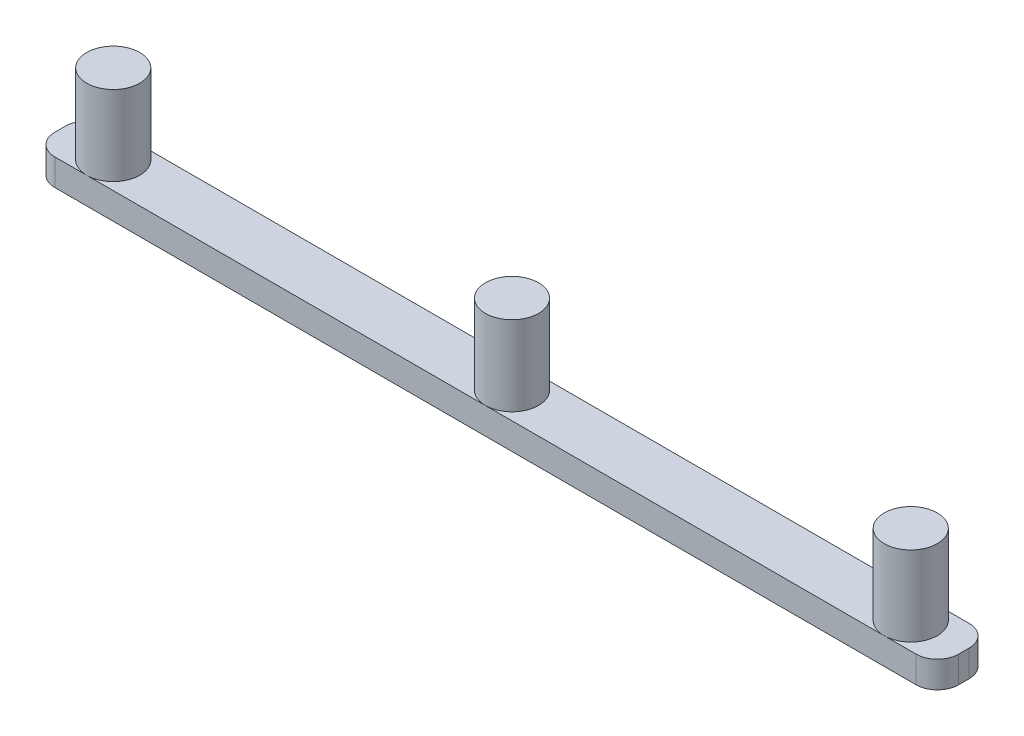
ISO-10303-21;
HEADER;
FILE_DESCRIPTION(('STEP AP214'),'2;1');
FILE_NAME('part.step','',(''),(''),'','','');
FILE_SCHEMA(('AUTOMOTIVE_DESIGN { 1 0 10303 214 1 1 1 1 }'));
ENDSEC;
DATA;
#1=APPLICATION_CONTEXT('core data for automotive mechanical design processes');
#2=APPLICATION_PROTOCOL_DEFINITION('international standard','automotive_design',2000,#1);
#3=PRODUCT_CONTEXT('',#1,'mechanical');
#4=PRODUCT('Part','Part','',(#3));
#5=PRODUCT_RELATED_PRODUCT_CATEGORY('part','',(#4));
#6=PRODUCT_DEFINITION_FORMATION('','',#4);
#7=PRODUCT_DEFINITION_CONTEXT('part definition',#1,'design');
#8=PRODUCT_DEFINITION('design','',#6,#7);
#9=PRODUCT_DEFINITION_SHAPE('','',#8);
#10=(LENGTH_UNIT() NAMED_UNIT(*) SI_UNIT(.MILLI.,.METRE.));
#11=(NAMED_UNIT(*) PLANE_ANGLE_UNIT() SI_UNIT($,.RADIAN.));
#12=(NAMED_UNIT(*) SI_UNIT($,.STERADIAN.) SOLID_ANGLE_UNIT());
#13=UNCERTAINTY_MEASURE_WITH_UNIT(LENGTH_MEASURE(1.E-05),#10,'distance_accuracy_value','');
#14=(GEOMETRIC_REPRESENTATION_CONTEXT(3) GLOBAL_UNCERTAINTY_ASSIGNED_CONTEXT((#13)) GLOBAL_UNIT_ASSIGNED_CONTEXT((#10,
#11,#12)) REPRESENTATION_CONTEXT('',''));
#15=CARTESIAN_POINT('',(0.,0.,0.));
#16=DIRECTION('',(0.,0.,1.));
#17=DIRECTION('',(1.,0.,0.));
#18=AXIS2_PLACEMENT_3D('',#15,#16,#17);
#19=CARTESIAN_POINT('',(-4.,5.,-6.));
#20=DIRECTION('',(0.,1.,0.));
#21=DIRECTION('',(0.,0.,1.));
#22=AXIS2_PLACEMENT_3D('',#19,#20,#21);
#23=PLANE('',#22);
#24=DIRECTION('',(1.,0.,0.));
#25=VECTOR('',#24,1.);
#26=CARTESIAN_POINT('',(-4.00000000000003,5.,0.));
#27=LINE('',#26,#25);
#28=CARTESIAN_POINT('',(-85.,5.,0.));
#29=VERTEX_POINT('',#28);
#30=CARTESIAN_POINT('',(-10.,5.,0.));
#31=VERTEX_POINT('',#30);
#32=EDGE_CURVE('E128',#29,#31,#27,.T.);
#33=ORIENTED_EDGE('',*,*,#32,.T.);
#34=CARTESIAN_POINT('',(-10.,5.,-5.));
#35=DIRECTION('',(0.,1.,0.));
#36=DIRECTION('',(0.,0.,1.));
#37=AXIS2_PLACEMENT_3D('',#34,#35,#36);
#38=CIRCLE('',#37,5.);
#39=CARTESIAN_POINT('',(-10.,5.,-10.));
#40=VERTEX_POINT('',#39);
#41=EDGE_CURVE('E49',#40,#31,#38,.T.);
#42=ORIENTED_EDGE('',*,*,#41,.F.);
#43=DIRECTION('',(-1.,0.,0.));
#44=VECTOR('',#43,1.);
#45=CARTESIAN_POINT('',(-4.00000000000003,5.,-10.));
#46=LINE('',#45,#44);
#47=CARTESIAN_POINT('',(-85.,5.,-9.99999999999999));
#48=VERTEX_POINT('',#47);
#49=EDGE_CURVE('E126',#40,#48,#46,.T.);
#50=ORIENTED_EDGE('',*,*,#49,.T.);
#51=CARTESIAN_POINT('',(-85.,5.,-5.));
#52=DIRECTION('',(0.,1.,0.));
#53=DIRECTION('',(0.,0.,1.));
#54=AXIS2_PLACEMENT_3D('',#51,#52,#53);
#55=CIRCLE('',#54,5.);
#56=EDGE_CURVE('E160',#29,#48,#55,.T.);
#57=ORIENTED_EDGE('',*,*,#56,.F.);
#58=EDGE_LOOP('',(#33,#42,#50,#57));
#59=FACE_BOUND('',#58,.T.);
#60=ADVANCED_FACE('F33',(#59),#23,.T.);
#61=CARTESIAN_POINT('',(-4.00000000000003,5.,-10.));
#62=VERTEX_POINT('',#61);
#63=EDGE_CURVE('E133',#62,#40,#46,.T.);
#64=ORIENTED_EDGE('',*,*,#63,.T.);
#65=EDGE_CURVE('E116',#31,#40,#38,.T.);
#66=ORIENTED_EDGE('',*,*,#65,.F.);
#67=CARTESIAN_POINT('',(-4.00000000000003,5.,0.));
#68=VERTEX_POINT('',#67);
#69=EDGE_CURVE('E216',#31,#68,#27,.T.);
#70=ORIENTED_EDGE('',*,*,#69,.T.);
#71=CARTESIAN_POINT('',(-4.,5.,-4.));
#72=DIRECTION('',(0.,1.,0.));
#73=DIRECTION('',(0.,0.,-1.));
#74=AXIS2_PLACEMENT_3D('',#71,#72,#73);
#75=CIRCLE('',#74,4.);
#76=CARTESIAN_POINT('',(0.,5.,-4.00000000000003));
#77=VERTEX_POINT('',#76);
#78=EDGE_CURVE('E215',#68,#77,#75,.T.);
#79=ORIENTED_EDGE('',*,*,#78,.T.);
#80=DIRECTION('',(0.,0.,-1.));
#81=VECTOR('',#80,1.);
#82=CARTESIAN_POINT('',(0.,5.,-4.00000000000003));
#83=LINE('',#82,#81);
#84=CARTESIAN_POINT('',(0.,5.,-5.99999999999997));
#85=VERTEX_POINT('',#84);
#86=EDGE_CURVE('E222',#77,#85,#83,.T.);
#87=ORIENTED_EDGE('',*,*,#86,.T.);
#88=CARTESIAN_POINT('',(-4.,5.,-6.));
#89=DIRECTION('',(0.,1.,0.));
#90=DIRECTION('',(0.,0.,1.));
#91=AXIS2_PLACEMENT_3D('',#88,#89,#90);
#92=CIRCLE('',#91,4.);
#93=EDGE_CURVE('E140',#85,#62,#92,.T.);
#94=ORIENTED_EDGE('',*,*,#93,.T.);
#95=EDGE_LOOP('',(#64,#66,#70,#79,#87,#94));
#96=FACE_BOUND('',#95,.T.);
#97=ADVANCED_FACE('F138',(#96),#23,.T.);
#98=CARTESIAN_POINT('',(-160.,5.,0.));
#99=VERTEX_POINT('',#98);
#100=EDGE_CURVE('E210',#99,#29,#27,.T.);
#101=ORIENTED_EDGE('',*,*,#100,.T.);
#102=EDGE_CURVE('E56',#48,#29,#55,.T.);
#103=ORIENTED_EDGE('',*,*,#102,.F.);
#104=CARTESIAN_POINT('',(-160.,5.,-9.99999999999998));
#105=VERTEX_POINT('',#104);
#106=EDGE_CURVE('E136',#48,#105,#46,.T.);
#107=ORIENTED_EDGE('',*,*,#106,.T.);
#108=CARTESIAN_POINT('',(-160.,5.,-5.));
#109=DIRECTION('',(0.,1.,0.));
#110=DIRECTION('',(0.,0.,1.));
#111=AXIS2_PLACEMENT_3D('',#108,#109,#110);
#112=CIRCLE('',#111,4.99999999999999);
#113=EDGE_CURVE('E43',#99,#105,#112,.T.);
#114=ORIENTED_EDGE('',*,*,#113,.F.);
#115=EDGE_LOOP('',(#101,#103,#107,#114));
#116=FACE_BOUND('',#115,.T.);
#117=ADVANCED_FACE('F186',(#116),#23,.T.);
#118=CARTESIAN_POINT('',(-4.,5.,-6.));
#119=DIRECTION('',(0.,-1.,0.));
#120=DIRECTION('',(0.,0.,-1.));
#121=AXIS2_PLACEMENT_3D('',#118,#119,#120);
#122=CYLINDRICAL_SURFACE('',#121,4.);
#123=CARTESIAN_POINT('',(-4.,0.,-6.));
#124=DIRECTION('',(0.,1.,0.));
#125=DIRECTION('',(0.,0.,1.));
#126=AXIS2_PLACEMENT_3D('',#123,#124,#125);
#127=CIRCLE('',#126,4.);
#128=CARTESIAN_POINT('',(0.,0.,-5.99999999999997));
#129=VERTEX_POINT('',#128);
#130=CARTESIAN_POINT('',(-4.00000000000003,0.,-10.));
#131=VERTEX_POINT('',#130);
#132=EDGE_CURVE('E159',#129,#131,#127,.T.);
#133=ORIENTED_EDGE('',*,*,#132,.T.);
#134=DIRECTION('',(0.,-1.,0.));
#135=VECTOR('',#134,1.);
#136=CARTESIAN_POINT('',(-4.00000000000003,5.,-10.));
#137=LINE('',#136,#135);
#138=EDGE_CURVE('E37',#62,#131,#137,.T.);
#139=ORIENTED_EDGE('',*,*,#138,.F.);
#140=ORIENTED_EDGE('',*,*,#93,.F.);
#141=DIRECTION('',(0.,-1.,0.));
#142=VECTOR('',#141,1.);
#143=CARTESIAN_POINT('',(0.,5.,-5.99999999999997));
#144=LINE('',#143,#142);
#145=EDGE_CURVE('E224',#85,#129,#144,.T.);
#146=ORIENTED_EDGE('',*,*,#145,.T.);
#147=EDGE_LOOP('',(#133,#139,#140,#146));
#148=FACE_BOUND('',#147,.T.);
#149=ADVANCED_FACE('F35',(#148),#122,.T.);
#150=CARTESIAN_POINT('',(-4.00000000000003,5.,-10.));
#151=DIRECTION('',(0.,0.,1.));
#152=DIRECTION('',(1.,0.,0.));
#153=AXIS2_PLACEMENT_3D('',#150,#151,#152);
#154=PLANE('',#153);
#155=DIRECTION('',(-1.,0.,0.));
#156=VECTOR('',#155,1.);
#157=CARTESIAN_POINT('',(-4.00000000000003,0.,-10.));
#158=LINE('',#157,#156);
#159=CARTESIAN_POINT('',(-166.,0.,-9.99999999999998));
#160=VERTEX_POINT('',#159);
#161=EDGE_CURVE('E227',#131,#160,#158,.T.);
#162=ORIENTED_EDGE('',*,*,#161,.T.);
#163=DIRECTION('',(0.,-1.,0.));
#164=VECTOR('',#163,1.);
#165=CARTESIAN_POINT('',(-166.,5.,-9.99999999999998));
#166=LINE('',#165,#164);
#167=CARTESIAN_POINT('',(-166.,5.,-9.99999999999998));
#168=VERTEX_POINT('',#167);
#169=EDGE_CURVE('E254',#168,#160,#166,.T.);
#170=ORIENTED_EDGE('',*,*,#169,.F.);
#171=EDGE_CURVE('E143',#105,#168,#46,.T.);
#172=ORIENTED_EDGE('',*,*,#171,.F.);
#173=ORIENTED_EDGE('',*,*,#106,.F.);
#174=ORIENTED_EDGE('',*,*,#49,.F.);
#175=ORIENTED_EDGE('',*,*,#63,.F.);
#176=ORIENTED_EDGE('',*,*,#138,.T.);
#177=EDGE_LOOP('',(#162,#170,#172,#173,#174,#175,#176));
#178=FACE_BOUND('',#177,.T.);
#179=ADVANCED_FACE('F131',(#178),#154,.F.);
#180=CARTESIAN_POINT('',(-166.,5.,-5.99999999999998));
#181=DIRECTION('',(0.,-1.,0.));
#182=DIRECTION('',(0.,0.,-1.));
#183=AXIS2_PLACEMENT_3D('',#180,#181,#182);
#184=CYLINDRICAL_SURFACE('',#183,4.);
#185=CARTESIAN_POINT('',(-166.,0.,-5.99999999999998));
#186=DIRECTION('',(0.,1.,0.));
#187=DIRECTION('',(0.,0.,-1.));
#188=AXIS2_PLACEMENT_3D('',#185,#186,#187);
#189=CIRCLE('',#188,4.);
#190=CARTESIAN_POINT('',(-170.,0.,-5.99999999999995));
#191=VERTEX_POINT('',#190);
#192=EDGE_CURVE('E229',#160,#191,#189,.T.);
#193=ORIENTED_EDGE('',*,*,#192,.T.);
#194=DIRECTION('',(0.,-1.,0.));
#195=VECTOR('',#194,1.);
#196=CARTESIAN_POINT('',(-170.,5.,-5.99999999999995));
#197=LINE('',#196,#195);
#198=CARTESIAN_POINT('',(-170.,5.,-5.99999999999995));
#199=VERTEX_POINT('',#198);
#200=EDGE_CURVE('E252',#199,#191,#197,.T.);
#201=ORIENTED_EDGE('',*,*,#200,.F.);
#202=CARTESIAN_POINT('',(-166.,5.,-5.99999999999998));
#203=DIRECTION('',(0.,1.,0.));
#204=DIRECTION('',(0.,0.,-1.));
#205=AXIS2_PLACEMENT_3D('',#202,#203,#204);
#206=CIRCLE('',#205,4.);
#207=EDGE_CURVE('E142',#168,#199,#206,.T.);
#208=ORIENTED_EDGE('',*,*,#207,.F.);
#209=ORIENTED_EDGE('',*,*,#169,.T.);
#210=EDGE_LOOP('',(#193,#201,#208,#209));
#211=FACE_BOUND('',#210,.T.);
#212=ADVANCED_FACE('F266',(#211),#184,.T.);
#213=CARTESIAN_POINT('',(-170.,5.,-4.00000000000001));
#214=DIRECTION('',(1.,0.,0.));
#215=DIRECTION('',(0.,0.,-1.));
#216=AXIS2_PLACEMENT_3D('',#213,#214,#215);
#217=PLANE('',#216);
#218=DIRECTION('',(0.,0.,1.));
#219=VECTOR('',#218,1.);
#220=CARTESIAN_POINT('',(-170.,0.,-4.00000000000001));
#221=LINE('',#220,#219);
#222=CARTESIAN_POINT('',(-170.,0.,-4.00000000000001));
#223=VERTEX_POINT('',#222);
#224=EDGE_CURVE('E231',#191,#223,#221,.T.);
#225=ORIENTED_EDGE('',*,*,#224,.T.);
#226=DIRECTION('',(0.,-1.,0.));
#227=VECTOR('',#226,1.);
#228=CARTESIAN_POINT('',(-170.,5.,-4.00000000000001));
#229=LINE('',#228,#227);
#230=CARTESIAN_POINT('',(-170.,5.,-4.00000000000001));
#231=VERTEX_POINT('',#230);
#232=EDGE_CURVE('E249',#231,#223,#229,.T.);
#233=ORIENTED_EDGE('',*,*,#232,.F.);
#234=DIRECTION('',(0.,0.,1.));
#235=VECTOR('',#234,1.);
#236=CARTESIAN_POINT('',(-170.,5.,-4.00000000000001));
#237=LINE('',#236,#235);
#238=EDGE_CURVE('E144',#199,#231,#237,.T.);
#239=ORIENTED_EDGE('',*,*,#238,.F.);
#240=ORIENTED_EDGE('',*,*,#200,.T.);
#241=EDGE_LOOP('',(#225,#233,#239,#240));
#242=FACE_BOUND('',#241,.T.);
#243=ADVANCED_FACE('F269',(#242),#217,.F.);
#244=CARTESIAN_POINT('',(-166.,5.,-3.99999999999998));
#245=DIRECTION('',(0.,-1.,0.));
#246=DIRECTION('',(0.,0.,-1.));
#247=AXIS2_PLACEMENT_3D('',#244,#245,#246);
#248=CYLINDRICAL_SURFACE('',#247,4.);
#249=CARTESIAN_POINT('',(-166.,0.,-3.99999999999998));
#250=DIRECTION('',(0.,1.,0.));
#251=DIRECTION('',(0.,0.,-1.));
#252=AXIS2_PLACEMENT_3D('',#249,#250,#251);
#253=CIRCLE('',#252,4.);
#254=CARTESIAN_POINT('',(-166.,0.,0.));
#255=VERTEX_POINT('',#254);
#256=EDGE_CURVE('E233',#223,#255,#253,.T.);
#257=ORIENTED_EDGE('',*,*,#256,.T.);
#258=DIRECTION('',(0.,-1.,0.));
#259=VECTOR('',#258,1.);
#260=CARTESIAN_POINT('',(-166.,5.,0.));
#261=LINE('',#260,#259);
#262=CARTESIAN_POINT('',(-166.,5.,0.));
#263=VERTEX_POINT('',#262);
#264=EDGE_CURVE('E246',#263,#255,#261,.T.);
#265=ORIENTED_EDGE('',*,*,#264,.F.);
#266=CARTESIAN_POINT('',(-166.,5.,-3.99999999999998));
#267=DIRECTION('',(0.,1.,0.));
#268=DIRECTION('',(0.,0.,-1.));
#269=AXIS2_PLACEMENT_3D('',#266,#267,#268);
#270=CIRCLE('',#269,4.);
#271=EDGE_CURVE('E219',#231,#263,#270,.T.);
#272=ORIENTED_EDGE('',*,*,#271,.F.);
#273=ORIENTED_EDGE('',*,*,#232,.T.);
#274=EDGE_LOOP('',(#257,#265,#272,#273));
#275=FACE_BOUND('',#274,.T.);
#276=ADVANCED_FACE('F281',(#275),#248,.T.);
#277=CARTESIAN_POINT('',(-4.00000000000003,5.,0.));
#278=DIRECTION('',(0.,0.,-1.));
#279=DIRECTION('',(-1.,0.,0.));
#280=AXIS2_PLACEMENT_3D('',#277,#278,#279);
#281=PLANE('',#280);
#282=DIRECTION('',(1.,0.,0.));
#283=VECTOR('',#282,1.);
#284=CARTESIAN_POINT('',(-4.00000000000003,0.,0.));
#285=LINE('',#284,#283);
#286=CARTESIAN_POINT('',(-4.00000000000003,0.,0.));
#287=VERTEX_POINT('',#286);
#288=EDGE_CURVE('E235',#255,#287,#285,.T.);
#289=ORIENTED_EDGE('',*,*,#288,.T.);
#290=DIRECTION('',(0.,-1.,0.));
#291=VECTOR('',#290,1.);
#292=CARTESIAN_POINT('',(-4.00000000000003,5.,0.));
#293=LINE('',#292,#291);
#294=EDGE_CURVE('E243',#68,#287,#293,.T.);
#295=ORIENTED_EDGE('',*,*,#294,.F.);
#296=ORIENTED_EDGE('',*,*,#69,.F.);
#297=ORIENTED_EDGE('',*,*,#32,.F.);
#298=ORIENTED_EDGE('',*,*,#100,.F.);
#299=EDGE_CURVE('E213',#263,#99,#27,.T.);
#300=ORIENTED_EDGE('',*,*,#299,.F.);
#301=ORIENTED_EDGE('',*,*,#264,.T.);
#302=EDGE_LOOP('',(#289,#295,#296,#297,#298,#300,#301));
#303=FACE_BOUND('',#302,.T.);
#304=ADVANCED_FACE('F276',(#303),#281,.F.);
#305=CARTESIAN_POINT('',(-4.,5.,-4.));
#306=DIRECTION('',(0.,-1.,0.));
#307=DIRECTION('',(0.,0.,-1.));
#308=AXIS2_PLACEMENT_3D('',#305,#306,#307);
#309=CYLINDRICAL_SURFACE('',#308,4.);
#310=CARTESIAN_POINT('',(-4.,0.,-4.));
#311=DIRECTION('',(0.,1.,0.));
#312=DIRECTION('',(0.,0.,-1.));
#313=AXIS2_PLACEMENT_3D('',#310,#311,#312);
#314=CIRCLE('',#313,4.);
#315=CARTESIAN_POINT('',(0.,0.,-4.00000000000003));
#316=VERTEX_POINT('',#315);
#317=EDGE_CURVE('E151',#287,#316,#314,.T.);
#318=ORIENTED_EDGE('',*,*,#317,.T.);
#319=DIRECTION('',(0.,-1.,0.));
#320=VECTOR('',#319,1.);
#321=CARTESIAN_POINT('',(0.,5.,-4.00000000000003));
#322=LINE('',#321,#320);
#323=EDGE_CURVE('E240',#77,#316,#322,.T.);
#324=ORIENTED_EDGE('',*,*,#323,.F.);
#325=ORIENTED_EDGE('',*,*,#78,.F.);
#326=ORIENTED_EDGE('',*,*,#294,.T.);
#327=EDGE_LOOP('',(#318,#324,#325,#326));
#328=FACE_BOUND('',#327,.T.);
#329=ADVANCED_FACE('F198',(#328),#309,.T.);
#330=CARTESIAN_POINT('',(0.,5.,-4.00000000000003));
#331=DIRECTION('',(-1.,0.,0.));
#332=DIRECTION('',(0.,0.,1.));
#333=AXIS2_PLACEMENT_3D('',#330,#331,#332);
#334=PLANE('',#333);
#335=DIRECTION('',(0.,0.,-1.));
#336=VECTOR('',#335,1.);
#337=CARTESIAN_POINT('',(0.,0.,-4.00000000000003));
#338=LINE('',#337,#336);
#339=EDGE_CURVE('E150',#316,#129,#338,.T.);
#340=ORIENTED_EDGE('',*,*,#339,.T.);
#341=ORIENTED_EDGE('',*,*,#145,.F.);
#342=ORIENTED_EDGE('',*,*,#86,.F.);
#343=ORIENTED_EDGE('',*,*,#323,.T.);
#344=EDGE_LOOP('',(#340,#341,#342,#343));
#345=FACE_BOUND('',#344,.T.);
#346=ADVANCED_FACE('F191',(#345),#334,.F.);
#347=EDGE_CURVE('E11',#105,#99,#112,.T.);
#348=ORIENTED_EDGE('',*,*,#347,.F.);
#349=ORIENTED_EDGE('',*,*,#171,.T.);
#350=ORIENTED_EDGE('',*,*,#207,.T.);
#351=ORIENTED_EDGE('',*,*,#238,.T.);
#352=ORIENTED_EDGE('',*,*,#271,.T.);
#353=ORIENTED_EDGE('',*,*,#299,.T.);
#354=EDGE_LOOP('',(#348,#349,#350,#351,#352,#353));
#355=FACE_BOUND('',#354,.T.);
#356=ADVANCED_FACE('F182',(#355),#23,.T.);
#357=CARTESIAN_POINT('',(-4.,0.,-6.));
#358=DIRECTION('',(0.,1.,0.));
#359=DIRECTION('',(0.,0.,1.));
#360=AXIS2_PLACEMENT_3D('',#357,#358,#359);
#361=PLANE('',#360);
#362=ORIENTED_EDGE('',*,*,#132,.F.);
#363=ORIENTED_EDGE('',*,*,#339,.F.);
#364=ORIENTED_EDGE('',*,*,#317,.F.);
#365=ORIENTED_EDGE('',*,*,#288,.F.);
#366=ORIENTED_EDGE('',*,*,#256,.F.);
#367=ORIENTED_EDGE('',*,*,#224,.F.);
#368=ORIENTED_EDGE('',*,*,#192,.F.);
#369=ORIENTED_EDGE('',*,*,#161,.F.);
#370=EDGE_LOOP('',(#362,#363,#364,#365,#366,#367,#368,#369));
#371=FACE_BOUND('',#370,.T.);
#372=ADVANCED_FACE('F190',(#371),#361,.F.);
#373=CARTESIAN_POINT('',(-160.,20.,-5.));
#374=DIRECTION('',(0.,-1.,0.));
#375=DIRECTION('',(0.,0.,-1.));
#376=AXIS2_PLACEMENT_3D('',#373,#374,#375);
#377=CYLINDRICAL_SURFACE('',#376,4.99999999999999);
#378=CARTESIAN_POINT('',(-160.,20.,-5.));
#379=DIRECTION('',(0.,1.,0.));
#380=DIRECTION('',(0.,0.,1.));
#381=AXIS2_PLACEMENT_3D('',#378,#379,#380);
#382=CIRCLE('',#381,4.99999999999999);
#383=CARTESIAN_POINT('',(-160.,20.,0.));
#384=VERTEX_POINT('',#383);
#385=EDGE_CURVE('E155',#384,#384,#382,.T.);
#386=ORIENTED_EDGE('',*,*,#385,.F.);
#387=EDGE_LOOP('',(#386));
#388=FACE_BOUND('',#387,.T.);
#389=ORIENTED_EDGE('',*,*,#113,.T.);
#390=ORIENTED_EDGE('',*,*,#347,.T.);
#391=EDGE_LOOP('',(#389,#390));
#392=FACE_BOUND('',#391,.T.);
#393=ADVANCED_FACE('F196',(#388,#392),#377,.T.);
#394=CARTESIAN_POINT('',(-160.,20.,-5.));
#395=DIRECTION('',(0.,1.,0.));
#396=DIRECTION('',(0.,0.,1.));
#397=AXIS2_PLACEMENT_3D('',#394,#395,#396);
#398=PLANE('',#397);
#399=ORIENTED_EDGE('',*,*,#385,.T.);
#400=EDGE_LOOP('',(#399));
#401=FACE_BOUND('',#400,.T.);
#402=ADVANCED_FACE('F284',(#401),#398,.T.);
#403=CARTESIAN_POINT('',(-85.,20.,-5.));
#404=DIRECTION('',(0.,-1.,0.));
#405=DIRECTION('',(0.,0.,-1.));
#406=AXIS2_PLACEMENT_3D('',#403,#404,#405);
#407=CYLINDRICAL_SURFACE('',#406,5.);
#408=CARTESIAN_POINT('',(-85.,20.,-5.));
#409=DIRECTION('',(0.,1.,0.));
#410=DIRECTION('',(0.,0.,1.));
#411=AXIS2_PLACEMENT_3D('',#408,#409,#410);
#412=CIRCLE('',#411,5.);
#413=CARTESIAN_POINT('',(-85.,20.,0.));
#414=VERTEX_POINT('',#413);
#415=EDGE_CURVE('E156',#414,#414,#412,.T.);
#416=ORIENTED_EDGE('',*,*,#415,.F.);
#417=EDGE_LOOP('',(#416));
#418=FACE_BOUND('',#417,.T.);
#419=ORIENTED_EDGE('',*,*,#56,.T.);
#420=ORIENTED_EDGE('',*,*,#102,.T.);
#421=EDGE_LOOP('',(#419,#420));
#422=FACE_BOUND('',#421,.T.);
#423=ADVANCED_FACE('F177',(#418,#422),#407,.T.);
#424=CARTESIAN_POINT('',(-85.,20.,-5.));
#425=DIRECTION('',(0.,1.,0.));
#426=DIRECTION('',(0.,0.,1.));
#427=AXIS2_PLACEMENT_3D('',#424,#425,#426);
#428=PLANE('',#427);
#429=ORIENTED_EDGE('',*,*,#415,.T.);
#430=EDGE_LOOP('',(#429));
#431=FACE_BOUND('',#430,.T.);
#432=ADVANCED_FACE('F170',(#431),#428,.T.);
#433=CARTESIAN_POINT('',(-10.,20.,-5.));
#434=DIRECTION('',(0.,-1.,0.));
#435=DIRECTION('',(0.,0.,-1.));
#436=AXIS2_PLACEMENT_3D('',#433,#434,#435);
#437=CYLINDRICAL_SURFACE('',#436,5.);
#438=CARTESIAN_POINT('',(-10.,20.,-5.));
#439=DIRECTION('',(0.,1.,0.));
#440=DIRECTION('',(0.,0.,1.));
#441=AXIS2_PLACEMENT_3D('',#438,#439,#440);
#442=CIRCLE('',#441,5.);
#443=CARTESIAN_POINT('',(-10.,20.,0.));
#444=VERTEX_POINT('',#443);
#445=EDGE_CURVE('E121',#444,#444,#442,.T.);
#446=ORIENTED_EDGE('',*,*,#445,.F.);
#447=EDGE_LOOP('',(#446));
#448=FACE_BOUND('',#447,.T.);
#449=ORIENTED_EDGE('',*,*,#65,.T.);
#450=ORIENTED_EDGE('',*,*,#41,.T.);
#451=EDGE_LOOP('',(#449,#450));
#452=FACE_BOUND('',#451,.T.);
#453=ADVANCED_FACE('F117',(#448,#452),#437,.T.);
#454=CARTESIAN_POINT('',(-10.,20.,-5.));
#455=DIRECTION('',(0.,1.,0.));
#456=DIRECTION('',(0.,0.,1.));
#457=AXIS2_PLACEMENT_3D('',#454,#455,#456);
#458=PLANE('',#457);
#459=ORIENTED_EDGE('',*,*,#445,.T.);
#460=EDGE_LOOP('',(#459));
#461=FACE_BOUND('',#460,.T.);
#462=ADVANCED_FACE('F167',(#461),#458,.T.);
#463=CLOSED_SHELL('',(#60,#97,#117,#149,#179,#212,#243,#276,#304,#329,#346,#356,#372,#393,#402,
#423,#432,#453,#462));
#464=MANIFOLD_SOLID_BREP('B2',#463);
#465=ADVANCED_BREP_SHAPE_REPRESENTATION('',(#18,#464),#14);
#466=SHAPE_DEFINITION_REPRESENTATION(#9,#465);
ENDSEC;
END-ISO-10303-21;
